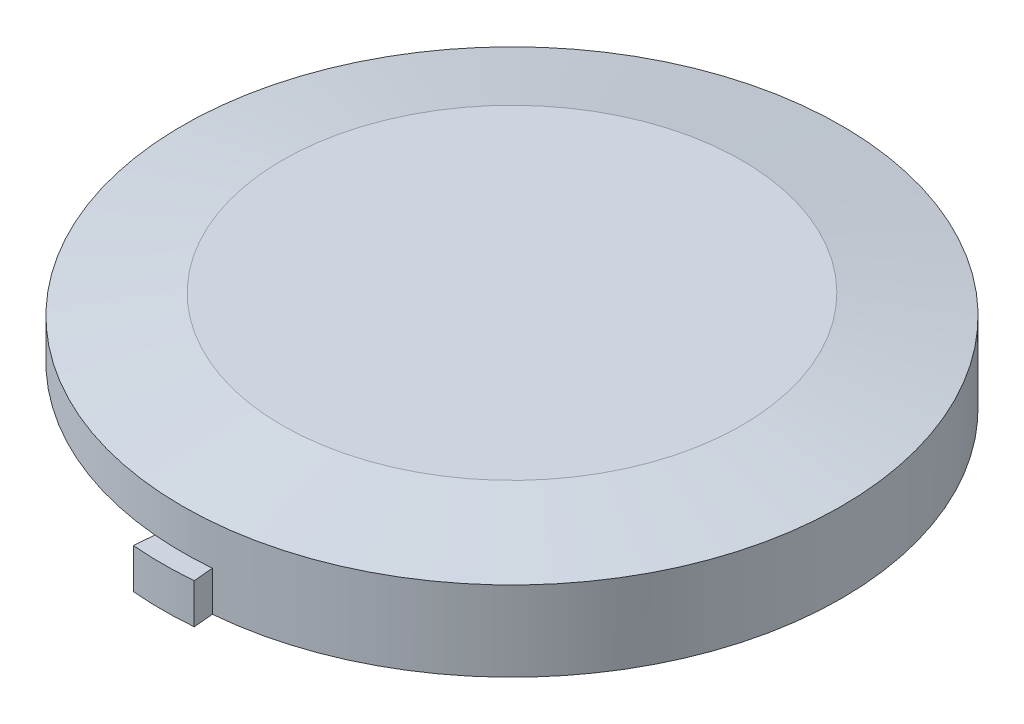
ISO-10303-21;
HEADER;
FILE_DESCRIPTION(('STEP AP214'),'2;1');
FILE_NAME('part.step','',(''),(''),'','','');
FILE_SCHEMA(('AUTOMOTIVE_DESIGN { 1 0 10303 214 1 1 1 1 }'));
ENDSEC;
DATA;
#1=APPLICATION_CONTEXT('core data for automotive mechanical design processes');
#2=APPLICATION_PROTOCOL_DEFINITION('international standard','automotive_design',2000,#1);
#3=PRODUCT_CONTEXT('',#1,'mechanical');
#4=PRODUCT('Part','Part','',(#3));
#5=PRODUCT_RELATED_PRODUCT_CATEGORY('part','',(#4));
#6=PRODUCT_DEFINITION_FORMATION('','',#4);
#7=PRODUCT_DEFINITION_CONTEXT('part definition',#1,'design');
#8=PRODUCT_DEFINITION('design','',#6,#7);
#9=PRODUCT_DEFINITION_SHAPE('','',#8);
#10=(LENGTH_UNIT() NAMED_UNIT(*) SI_UNIT(.MILLI.,.METRE.));
#11=(NAMED_UNIT(*) PLANE_ANGLE_UNIT() SI_UNIT($,.RADIAN.));
#12=(NAMED_UNIT(*) SI_UNIT($,.STERADIAN.) SOLID_ANGLE_UNIT());
#13=UNCERTAINTY_MEASURE_WITH_UNIT(LENGTH_MEASURE(1.E-05),#10,'distance_accuracy_value','');
#14=(GEOMETRIC_REPRESENTATION_CONTEXT(3) GLOBAL_UNCERTAINTY_ASSIGNED_CONTEXT((#13)) GLOBAL_UNIT_ASSIGNED_CONTEXT((#10,
#11,#12)) REPRESENTATION_CONTEXT('',''));
#15=CARTESIAN_POINT('',(0.,0.,0.));
#16=DIRECTION('',(0.,0.,1.));
#17=DIRECTION('',(1.,0.,0.));
#18=AXIS2_PLACEMENT_3D('',#15,#16,#17);
#19=CARTESIAN_POINT('',(0.,5.,0.));
#20=DIRECTION('',(0.,-1.,0.));
#21=DIRECTION('',(0.,0.,-1.));
#22=AXIS2_PLACEMENT_3D('',#19,#20,#21);
#23=CYLINDRICAL_SURFACE('',#22,16.5);
#24=CARTESIAN_POINT('',(0.,4.,0.));
#25=DIRECTION('',(0.,1.,0.));
#26=DIRECTION('',(0.,0.,1.));
#27=AXIS2_PLACEMENT_3D('',#24,#25,#26);
#28=CIRCLE('',#27,16.5);
#29=CARTESIAN_POINT('',(0.,4.,16.5));
#30=VERTEX_POINT('',#29);
#31=EDGE_CURVE('E200',#30,#30,#28,.F.);
#32=ORIENTED_EDGE('',*,*,#31,.T.);
#33=EDGE_LOOP('',(#32));
#34=FACE_BOUND('',#33,.T.);
#35=CARTESIAN_POINT('',(0.,2.,0.));
#36=DIRECTION('',(0.,-1.,0.));
#37=DIRECTION('',(0.,0.,-1.));
#38=AXIS2_PLACEMENT_3D('',#35,#36,#37);
#39=CIRCLE('',#38,16.5);
#40=CARTESIAN_POINT('',(-1.43806975533631,2.,16.4372125185138));
#41=VERTEX_POINT('',#40);
#42=CARTESIAN_POINT('',(-16.2493279247014,2.,-2.86519493150436));
#43=VERTEX_POINT('',#42);
#44=EDGE_CURVE('E126',#41,#43,#39,.T.);
#45=ORIENTED_EDGE('',*,*,#44,.F.);
#46=CARTESIAN_POINT('',(0.,2.,0.));
#47=DIRECTION('',(0.,-1.,0.));
#48=DIRECTION('',(0.,0.,-1.));
#49=AXIS2_PLACEMENT_3D('',#46,#47,#48);
#50=CIRCLE('',#49,16.5);
#51=CARTESIAN_POINT('',(1.43806975533636,1.99999999999999,16.4372125185138));
#52=VERTEX_POINT('',#51);
#53=EDGE_CURVE('E49',#52,#41,#50,.T.);
#54=ORIENTED_EDGE('',*,*,#53,.F.);
#55=DIRECTION('',(0.,1.,0.));
#56=VECTOR('',#55,1.);
#57=CARTESIAN_POINT('',(1.43806975533636,0.,16.4372125185138));
#58=LINE('',#57,#56);
#59=CARTESIAN_POINT('',(1.43806975533636,0.,16.4372125185138));
#60=VERTEX_POINT('',#59);
#61=EDGE_CURVE('E146',#60,#52,#58,.T.);
#62=ORIENTED_EDGE('',*,*,#61,.F.);
#63=CARTESIAN_POINT('',(0.,0.,0.));
#64=DIRECTION('',(0.,1.,0.));
#65=DIRECTION('',(0.,0.,1.));
#66=AXIS2_PLACEMENT_3D('',#63,#64,#65);
#67=CIRCLE('',#66,16.5);
#68=CARTESIAN_POINT('',(1.43806975533636,0.,-16.4372125185138));
#69=VERTEX_POINT('',#68);
#70=EDGE_CURVE('E193',#60,#69,#67,.T.);
#71=ORIENTED_EDGE('',*,*,#70,.T.);
#72=DIRECTION('',(0.,-1.,0.));
#73=VECTOR('',#72,1.);
#74=CARTESIAN_POINT('',(1.43806975533636,0.,-16.4372125185138));
#75=LINE('',#74,#73);
#76=CARTESIAN_POINT('',(1.43806975533636,2.,-16.4372125185138));
#77=VERTEX_POINT('',#76);
#78=EDGE_CURVE('E162',#77,#69,#75,.T.);
#79=ORIENTED_EDGE('',*,*,#78,.F.);
#80=CARTESIAN_POINT('',(0.,2.,0.));
#81=DIRECTION('',(0.,-1.,0.));
#82=DIRECTION('',(0.,0.,-1.));
#83=AXIS2_PLACEMENT_3D('',#80,#81,#82);
#84=CIRCLE('',#83,16.5);
#85=CARTESIAN_POINT('',(-1.43806975533636,2.,-16.4372125185138));
#86=VERTEX_POINT('',#85);
#87=EDGE_CURVE('E56',#86,#77,#84,.T.);
#88=ORIENTED_EDGE('',*,*,#87,.F.);
#89=DIRECTION('',(0.,-1.,0.));
#90=VECTOR('',#89,1.);
#91=CARTESIAN_POINT('',(-1.43806975533636,0.,-16.4372125185138));
#92=LINE('',#91,#90);
#93=CARTESIAN_POINT('',(-1.43806975533636,0.,-16.4372125185138));
#94=VERTEX_POINT('',#93);
#95=EDGE_CURVE('E174',#86,#94,#92,.T.);
#96=ORIENTED_EDGE('',*,*,#95,.T.);
#97=CARTESIAN_POINT('',(-16.2493279247014,0.,-2.86519493150436));
#98=VERTEX_POINT('',#97);
#99=EDGE_CURVE('E133',#94,#98,#67,.T.);
#100=ORIENTED_EDGE('',*,*,#99,.T.);
#101=DIRECTION('',(0.,-1.,0.));
#102=VECTOR('',#101,1.);
#103=CARTESIAN_POINT('',(-16.2493279247014,0.,-2.86519493150436));
#104=LINE('',#103,#102);
#105=EDGE_CURVE('E119',#43,#98,#104,.T.);
#106=ORIENTED_EDGE('',*,*,#105,.F.);
#107=EDGE_LOOP('',(#45,#54,#62,#71,#79,#88,#96,#100,#106));
#108=FACE_BOUND('',#107,.T.);
#109=ADVANCED_FACE('F34',(#34,#108),#23,.T.);
#110=CARTESIAN_POINT('',(0.,5.,0.));
#111=DIRECTION('',(0.,1.,0.));
#112=DIRECTION('',(0.,0.,1.));
#113=AXIS2_PLACEMENT_3D('',#110,#111,#112);
#114=PLANE('',#113);
#115=CARTESIAN_POINT('',(0.,5.,0.));
#116=DIRECTION('',(0.,1.,0.));
#117=DIRECTION('',(0.,0.,1.));
#118=AXIS2_PLACEMENT_3D('',#115,#116,#117);
#119=CIRCLE('',#118,11.4999999999999);
#120=CARTESIAN_POINT('',(0.,5.,11.4999999999999));
#121=VERTEX_POINT('',#120);
#122=EDGE_CURVE('E197',#121,#121,#119,.T.);
#123=ORIENTED_EDGE('',*,*,#122,.T.);
#124=EDGE_LOOP('',(#123));
#125=FACE_BOUND('',#124,.T.);
#126=ADVANCED_FACE('F248',(#125),#114,.T.);
#127=CARTESIAN_POINT('',(0.,0.,0.));
#128=DIRECTION('',(0.,1.,0.));
#129=DIRECTION('',(0.,0.,1.));
#130=AXIS2_PLACEMENT_3D('',#127,#128,#129);
#131=PLANE('',#130);
#132=DIRECTION('',(0.0871557427476584,0.,-0.996194698091746));
#133=VECTOR('',#132,1.);
#134=CARTESIAN_POINT('',(-1.43806975533636,0.,16.4372125185138));
#135=LINE('',#134,#133);
#136=CARTESIAN_POINT('',(-1.52522549808402,0.,17.4334072166055));
#137=VERTEX_POINT('',#136);
#138=CARTESIAN_POINT('',(-1.17660252709334,0.,13.4486284242386));
#139=VERTEX_POINT('',#138);
#140=EDGE_CURVE('E144',#137,#139,#135,.T.);
#141=ORIENTED_EDGE('',*,*,#140,.T.);
#142=CARTESIAN_POINT('',(0.,0.,0.));
#143=DIRECTION('',(0.,1.,0.));
#144=DIRECTION('',(0.,0.,1.));
#145=AXIS2_PLACEMENT_3D('',#142,#143,#144);
#146=CIRCLE('',#145,13.5);
#147=CARTESIAN_POINT('',(-13.2949046656648,0.,-2.34425039850356));
#148=VERTEX_POINT('',#147);
#149=EDGE_CURVE('E189',#139,#148,#146,.T.);
#150=ORIENTED_EDGE('',*,*,#149,.T.);
#151=DIRECTION('',(0.984807753012208,0.,0.173648177666931));
#152=VECTOR('',#151,1.);
#153=CARTESIAN_POINT('',(0.,0.,0.));
#154=LINE('',#153,#152);
#155=EDGE_CURVE('E134',#98,#148,#154,.T.);
#156=ORIENTED_EDGE('',*,*,#155,.F.);
#157=ORIENTED_EDGE('',*,*,#99,.F.);
#158=DIRECTION('',(-0.0871557427476583,0.,-0.996194698091746));
#159=VECTOR('',#158,1.);
#160=CARTESIAN_POINT('',(-1.43806975533636,0.,-16.4372125185138));
#161=LINE('',#160,#159);
#162=CARTESIAN_POINT('',(-1.52522549808402,0.,-17.4334072166055));
#163=VERTEX_POINT('',#162);
#164=EDGE_CURVE('E176',#94,#163,#161,.T.);
#165=ORIENTED_EDGE('',*,*,#164,.T.);
#166=CARTESIAN_POINT('',(0.,0.,0.));
#167=DIRECTION('',(0.,-1.,0.));
#168=DIRECTION('',(0.,0.,-1.));
#169=AXIS2_PLACEMENT_3D('',#166,#167,#168);
#170=CIRCLE('',#169,17.5);
#171=CARTESIAN_POINT('',(1.52522549808402,0.,-17.4334072166055));
#172=VERTEX_POINT('',#171);
#173=EDGE_CURVE('E184',#163,#172,#170,.T.);
#174=ORIENTED_EDGE('',*,*,#173,.T.);
#175=DIRECTION('',(0.0871557427476584,0.,-0.996194698091746));
#176=VECTOR('',#175,1.);
#177=CARTESIAN_POINT('',(1.43806975533636,0.,-16.4372125185138));
#178=LINE('',#177,#176);
#179=EDGE_CURVE('E165',#69,#172,#178,.T.);
#180=ORIENTED_EDGE('',*,*,#179,.F.);
#181=ORIENTED_EDGE('',*,*,#70,.F.);
#182=DIRECTION('',(-0.0871557427476583,0.,-0.996194698091746));
#183=VECTOR('',#182,1.);
#184=CARTESIAN_POINT('',(1.43806975533636,0.,16.4372125185138));
#185=LINE('',#184,#183);
#186=CARTESIAN_POINT('',(1.52522549808402,0.,17.4334072166055));
#187=VERTEX_POINT('',#186);
#188=EDGE_CURVE('E154',#187,#60,#185,.T.);
#189=ORIENTED_EDGE('',*,*,#188,.F.);
#190=CARTESIAN_POINT('',(0.,0.,0.));
#191=DIRECTION('',(0.,-1.,0.));
#192=DIRECTION('',(0.,0.,-1.));
#193=AXIS2_PLACEMENT_3D('',#190,#191,#192);
#194=CIRCLE('',#193,17.5);
#195=EDGE_CURVE('E157',#187,#137,#194,.T.);
#196=ORIENTED_EDGE('',*,*,#195,.T.);
#197=EDGE_LOOP('',(#141,#150,#156,#157,#165,#174,#180,#181,#189,#196));
#198=FACE_BOUND('',#197,.T.);
#199=ADVANCED_FACE('F223',(#198),#131,.F.);
#200=CARTESIAN_POINT('',(0.,5.,0.));
#201=DIRECTION('',(0.,-1.,0.));
#202=DIRECTION('',(0.,0.,-1.));
#203=AXIS2_PLACEMENT_3D('',#200,#201,#202);
#204=CONICAL_SURFACE('',#203,11.4999999999999,1.37340076694502);
#205=ORIENTED_EDGE('',*,*,#31,.F.);
#206=EDGE_LOOP('',(#205));
#207=FACE_BOUND('',#206,.T.);
#208=ORIENTED_EDGE('',*,*,#122,.F.);
#209=EDGE_LOOP('',(#208));
#210=FACE_BOUND('',#209,.T.);
#211=ADVANCED_FACE('F36',(#207,#210),#204,.T.);
#212=CARTESIAN_POINT('',(0.,2.78,0.));
#213=DIRECTION('',(0.,-1.,0.));
#214=DIRECTION('',(0.,0.,-1.));
#215=AXIS2_PLACEMENT_3D('',#212,#213,#214);
#216=CYLINDRICAL_SURFACE('',#215,13.5);
#217=DIRECTION('',(0.,-1.,0.));
#218=VECTOR('',#217,1.);
#219=CARTESIAN_POINT('',(-1.17660252709334,2.78,13.4486284242386));
#220=LINE('',#219,#218);
#221=CARTESIAN_POINT('',(-1.17660252709334,2.,13.4486284242386));
#222=VERTEX_POINT('',#221);
#223=EDGE_CURVE('E11',#222,#139,#220,.T.);
#224=ORIENTED_EDGE('',*,*,#223,.F.);
#225=CARTESIAN_POINT('',(0.,2.,0.));
#226=DIRECTION('',(0.,-1.,0.));
#227=DIRECTION('',(0.,0.,-1.));
#228=AXIS2_PLACEMENT_3D('',#225,#226,#227);
#229=CIRCLE('',#228,13.5);
#230=CARTESIAN_POINT('',(-13.2949046656648,2.,-2.34425039850356));
#231=VERTEX_POINT('',#230);
#232=EDGE_CURVE('E42',#222,#231,#229,.T.);
#233=ORIENTED_EDGE('',*,*,#232,.T.);
#234=DIRECTION('',(0.,-1.,0.));
#235=VECTOR('',#234,1.);
#236=CARTESIAN_POINT('',(-13.2949046656648,2.78,-2.34425039850356));
#237=LINE('',#236,#235);
#238=EDGE_CURVE('E122',#231,#148,#237,.T.);
#239=ORIENTED_EDGE('',*,*,#238,.T.);
#240=ORIENTED_EDGE('',*,*,#149,.F.);
#241=EDGE_LOOP('',(#224,#233,#239,#240));
#242=FACE_BOUND('',#241,.T.);
#243=CARTESIAN_POINT('',(0.,2.78,0.));
#244=DIRECTION('',(0.,1.,0.));
#245=DIRECTION('',(0.,0.,1.));
#246=AXIS2_PLACEMENT_3D('',#243,#244,#245);
#247=CIRCLE('',#246,13.5);
#248=CARTESIAN_POINT('',(0.,2.78,13.5));
#249=VERTEX_POINT('',#248);
#250=EDGE_CURVE('E190',#249,#249,#247,.T.);
#251=ORIENTED_EDGE('',*,*,#250,.T.);
#252=EDGE_LOOP('',(#251));
#253=FACE_BOUND('',#252,.T.);
#254=ADVANCED_FACE('F205',(#242,#253),#216,.F.);
#255=CARTESIAN_POINT('',(0.,2.78,0.));
#256=DIRECTION('',(0.,1.,0.));
#257=DIRECTION('',(0.,0.,1.));
#258=AXIS2_PLACEMENT_3D('',#255,#256,#257);
#259=PLANE('',#258);
#260=ORIENTED_EDGE('',*,*,#250,.F.);
#261=EDGE_LOOP('',(#260));
#262=FACE_BOUND('',#261,.T.);
#263=ADVANCED_FACE('F260',(#262),#259,.F.);
#264=CARTESIAN_POINT('',(-1.43806975533636,2.,-16.4372125185138));
#265=DIRECTION('',(0.,1.,0.));
#266=DIRECTION('',(0.,0.,1.));
#267=AXIS2_PLACEMENT_3D('',#264,#265,#266);
#268=PLANE('',#267);
#269=CARTESIAN_POINT('',(0.,2.,0.));
#270=DIRECTION('',(0.,-1.,0.));
#271=DIRECTION('',(0.,0.,-1.));
#272=AXIS2_PLACEMENT_3D('',#269,#270,#271);
#273=CIRCLE('',#272,17.5);
#274=CARTESIAN_POINT('',(-1.52522549808402,2.,-17.4334072166055));
#275=VERTEX_POINT('',#274);
#276=CARTESIAN_POINT('',(1.52522549808402,2.,-17.4334072166055));
#277=VERTEX_POINT('',#276);
#278=EDGE_CURVE('E186',#275,#277,#273,.T.);
#279=ORIENTED_EDGE('',*,*,#278,.F.);
#280=DIRECTION('',(0.0871557427476583,0.,0.996194698091746));
#281=VECTOR('',#280,1.);
#282=CARTESIAN_POINT('',(-1.43806975533636,2.,-16.4372125185138));
#283=LINE('',#282,#281);
#284=EDGE_CURVE('E182',#275,#86,#283,.T.);
#285=ORIENTED_EDGE('',*,*,#284,.T.);
#286=ORIENTED_EDGE('',*,*,#87,.T.);
#287=DIRECTION('',(-0.0871557427476584,0.,0.996194698091746));
#288=VECTOR('',#287,1.);
#289=CARTESIAN_POINT('',(1.43806975533636,2.,-16.4372125185138));
#290=LINE('',#289,#288);
#291=EDGE_CURVE('E171',#277,#77,#290,.T.);
#292=ORIENTED_EDGE('',*,*,#291,.F.);
#293=EDGE_LOOP('',(#279,#285,#286,#292));
#294=FACE_BOUND('',#293,.T.);
#295=ADVANCED_FACE('F228',(#294),#268,.T.);
#296=CARTESIAN_POINT('',(0.,0.,0.));
#297=DIRECTION('',(0.,-1.,0.));
#298=DIRECTION('',(0.,0.,-1.));
#299=AXIS2_PLACEMENT_3D('',#296,#297,#298);
#300=CYLINDRICAL_SURFACE('',#299,17.5);
#301=ORIENTED_EDGE('',*,*,#173,.F.);
#302=DIRECTION('',(0.,1.,0.));
#303=VECTOR('',#302,1.);
#304=CARTESIAN_POINT('',(-1.52522549808402,0.,-17.4334072166055));
#305=LINE('',#304,#303);
#306=EDGE_CURVE('E179',#163,#275,#305,.T.);
#307=ORIENTED_EDGE('',*,*,#306,.T.);
#308=ORIENTED_EDGE('',*,*,#278,.T.);
#309=DIRECTION('',(0.,1.,0.));
#310=VECTOR('',#309,1.);
#311=CARTESIAN_POINT('',(1.52522549808402,0.,-17.4334072166055));
#312=LINE('',#311,#310);
#313=EDGE_CURVE('E168',#172,#277,#312,.T.);
#314=ORIENTED_EDGE('',*,*,#313,.F.);
#315=EDGE_LOOP('',(#301,#307,#308,#314));
#316=FACE_BOUND('',#315,.T.);
#317=ADVANCED_FACE('F234',(#316),#300,.T.);
#318=CARTESIAN_POINT('',(0.,0.,0.));
#319=DIRECTION('',(-0.996194698091746,0.,0.0871557427476583));
#320=DIRECTION('',(0.0871557427476583,0.,0.996194698091746));
#321=AXIS2_PLACEMENT_3D('',#318,#319,#320);
#322=PLANE('',#321);
#323=ORIENTED_EDGE('',*,*,#95,.F.);
#324=ORIENTED_EDGE('',*,*,#284,.F.);
#325=ORIENTED_EDGE('',*,*,#306,.F.);
#326=ORIENTED_EDGE('',*,*,#164,.F.);
#327=EDGE_LOOP('',(#323,#324,#325,#326));
#328=FACE_BOUND('',#327,.T.);
#329=ADVANCED_FACE('F238',(#328),#322,.T.);
#330=CARTESIAN_POINT('',(0.,0.,0.));
#331=DIRECTION('',(-0.996194698091746,0.,-0.0871557427476584));
#332=DIRECTION('',(-0.0871557427476584,0.,0.996194698091746));
#333=AXIS2_PLACEMENT_3D('',#330,#331,#332);
#334=PLANE('',#333);
#335=ORIENTED_EDGE('',*,*,#78,.T.);
#336=ORIENTED_EDGE('',*,*,#179,.T.);
#337=ORIENTED_EDGE('',*,*,#313,.T.);
#338=ORIENTED_EDGE('',*,*,#291,.T.);
#339=EDGE_LOOP('',(#335,#336,#337,#338));
#340=FACE_BOUND('',#339,.T.);
#341=ADVANCED_FACE('F231',(#340),#334,.F.);
#342=CARTESIAN_POINT('',(1.43806975533636,2.,16.4372125185138));
#343=DIRECTION('',(0.,-1.,0.));
#344=DIRECTION('',(0.,0.,-1.));
#345=AXIS2_PLACEMENT_3D('',#342,#343,#344);
#346=PLANE('',#345);
#347=CARTESIAN_POINT('',(0.,2.,0.));
#348=DIRECTION('',(0.,-1.,0.));
#349=DIRECTION('',(0.,0.,-1.));
#350=AXIS2_PLACEMENT_3D('',#347,#348,#349);
#351=CIRCLE('',#350,17.5);
#352=CARTESIAN_POINT('',(1.52522549808402,2.,17.4334072166055));
#353=VERTEX_POINT('',#352);
#354=CARTESIAN_POINT('',(-1.52522549808402,2.,17.4334072166055));
#355=VERTEX_POINT('',#354);
#356=EDGE_CURVE('E159',#353,#355,#351,.T.);
#357=ORIENTED_EDGE('',*,*,#356,.F.);
#358=DIRECTION('',(0.0871557427476583,0.,0.996194698091746));
#359=VECTOR('',#358,1.);
#360=CARTESIAN_POINT('',(1.43806975533636,2.,16.4372125185138));
#361=LINE('',#360,#359);
#362=EDGE_CURVE('E148',#52,#353,#361,.T.);
#363=ORIENTED_EDGE('',*,*,#362,.F.);
#364=ORIENTED_EDGE('',*,*,#53,.T.);
#365=DIRECTION('',(-0.0871557427476584,0.,0.996194698091746));
#366=VECTOR('',#365,1.);
#367=CARTESIAN_POINT('',(-1.43806975533636,2.,16.4372125185138));
#368=LINE('',#367,#366);
#369=EDGE_CURVE('E130',#41,#355,#368,.T.);
#370=ORIENTED_EDGE('',*,*,#369,.T.);
#371=EDGE_LOOP('',(#357,#363,#364,#370));
#372=FACE_BOUND('',#371,.T.);
#373=ADVANCED_FACE('F214',(#372),#346,.F.);
#374=CARTESIAN_POINT('',(0.,0.,0.));
#375=DIRECTION('',(0.,-1.,0.));
#376=DIRECTION('',(0.,0.,-1.));
#377=AXIS2_PLACEMENT_3D('',#374,#375,#376);
#378=CYLINDRICAL_SURFACE('',#377,17.5);
#379=ORIENTED_EDGE('',*,*,#195,.F.);
#380=DIRECTION('',(0.,-1.,0.));
#381=VECTOR('',#380,1.);
#382=CARTESIAN_POINT('',(1.52522549808402,0.,17.4334072166055));
#383=LINE('',#382,#381);
#384=EDGE_CURVE('E151',#353,#187,#383,.T.);
#385=ORIENTED_EDGE('',*,*,#384,.F.);
#386=ORIENTED_EDGE('',*,*,#356,.T.);
#387=DIRECTION('',(0.,-1.,0.));
#388=VECTOR('',#387,1.);
#389=CARTESIAN_POINT('',(-1.52522549808402,0.,17.4334072166055));
#390=LINE('',#389,#388);
#391=EDGE_CURVE('E141',#355,#137,#390,.T.);
#392=ORIENTED_EDGE('',*,*,#391,.T.);
#393=EDGE_LOOP('',(#379,#385,#386,#392));
#394=FACE_BOUND('',#393,.T.);
#395=ADVANCED_FACE('F221',(#394),#378,.T.);
#396=CARTESIAN_POINT('',(0.,0.,0.));
#397=DIRECTION('',(0.996194698091746,0.,-0.0871557427476583));
#398=DIRECTION('',(-0.0871557427476583,0.,-0.996194698091746));
#399=AXIS2_PLACEMENT_3D('',#396,#397,#398);
#400=PLANE('',#399);
#401=ORIENTED_EDGE('',*,*,#61,.T.);
#402=ORIENTED_EDGE('',*,*,#362,.T.);
#403=ORIENTED_EDGE('',*,*,#384,.T.);
#404=ORIENTED_EDGE('',*,*,#188,.T.);
#405=EDGE_LOOP('',(#401,#402,#403,#404));
#406=FACE_BOUND('',#405,.T.);
#407=ADVANCED_FACE('F218',(#406),#400,.T.);
#408=CARTESIAN_POINT('',(0.,0.,0.));
#409=DIRECTION('',(0.996194698091746,0.,0.0871557427476584));
#410=DIRECTION('',(0.0871557427476584,0.,-0.996194698091746));
#411=AXIS2_PLACEMENT_3D('',#408,#409,#410);
#412=PLANE('',#411);
#413=ORIENTED_EDGE('',*,*,#369,.F.);
#414=DIRECTION('',(-0.0871557427476549,0.,0.996194698091746));
#415=VECTOR('',#414,1.);
#416=CARTESIAN_POINT('',(0.,2.,0.));
#417=LINE('',#416,#415);
#418=EDGE_CURVE('E129',#222,#41,#417,.T.);
#419=ORIENTED_EDGE('',*,*,#418,.F.);
#420=ORIENTED_EDGE('',*,*,#223,.T.);
#421=ORIENTED_EDGE('',*,*,#140,.F.);
#422=ORIENTED_EDGE('',*,*,#391,.F.);
#423=EDGE_LOOP('',(#413,#419,#420,#421,#422));
#424=FACE_BOUND('',#423,.T.);
#425=ADVANCED_FACE('F210',(#424),#412,.F.);
#426=CARTESIAN_POINT('',(0.,2.,0.));
#427=DIRECTION('',(0.,-1.,0.));
#428=DIRECTION('',(0.,0.,-1.));
#429=AXIS2_PLACEMENT_3D('',#426,#427,#428);
#430=PLANE('',#429);
#431=ORIENTED_EDGE('',*,*,#418,.T.);
#432=ORIENTED_EDGE('',*,*,#44,.T.);
#433=DIRECTION('',(-0.984807753012208,0.,-0.173648177666931));
#434=VECTOR('',#433,1.);
#435=CARTESIAN_POINT('',(0.,2.,0.));
#436=LINE('',#435,#434);
#437=EDGE_CURVE('E115',#231,#43,#436,.T.);
#438=ORIENTED_EDGE('',*,*,#437,.F.);
#439=ORIENTED_EDGE('',*,*,#232,.F.);
#440=EDGE_LOOP('',(#431,#432,#438,#439));
#441=FACE_BOUND('',#440,.T.);
#442=ADVANCED_FACE('F127',(#441),#430,.T.);
#443=CARTESIAN_POINT('',(0.,0.,0.));
#444=DIRECTION('',(-0.173648177666931,0.,0.984807753012208));
#445=DIRECTION('',(0.984807753012208,0.,0.173648177666931));
#446=AXIS2_PLACEMENT_3D('',#443,#444,#445);
#447=PLANE('',#446);
#448=ORIENTED_EDGE('',*,*,#437,.T.);
#449=ORIENTED_EDGE('',*,*,#105,.T.);
#450=ORIENTED_EDGE('',*,*,#155,.T.);
#451=ORIENTED_EDGE('',*,*,#238,.F.);
#452=EDGE_LOOP('',(#448,#449,#450,#451));
#453=FACE_BOUND('',#452,.T.);
#454=ADVANCED_FACE('F117',(#453),#447,.T.);
#455=CLOSED_SHELL('',(#109,#126,#199,#211,#254,#263,#295,#317,#329,#341,#373,#395,#407,#425,
#442,#454));
#456=MANIFOLD_SOLID_BREP('B2',#455);
#457=ADVANCED_BREP_SHAPE_REPRESENTATION('',(#18,#456),#14);
#458=SHAPE_DEFINITION_REPRESENTATION(#9,#457);
ENDSEC;
END-ISO-10303-21;
